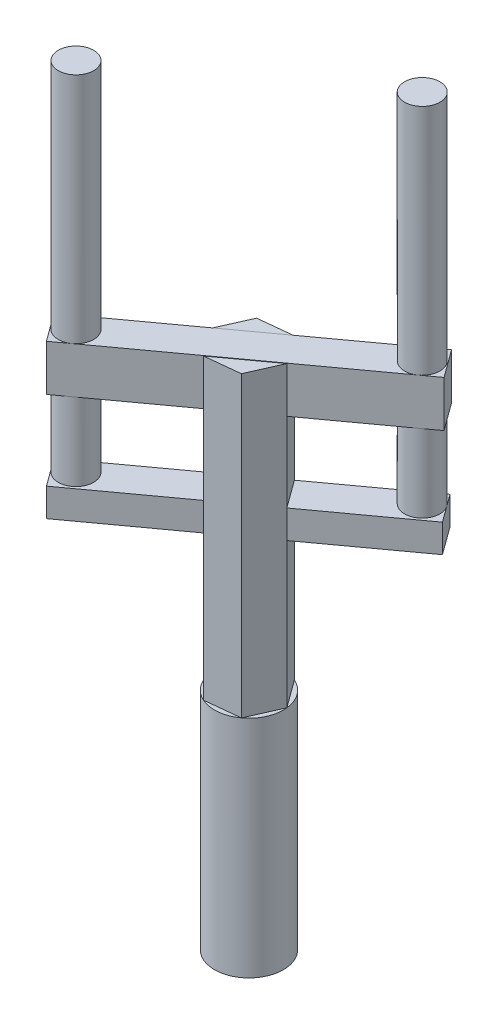
ISO-10303-21;
HEADER;
FILE_DESCRIPTION(('STEP AP214'),'2;1');
FILE_NAME('part.step','',(''),(''),'','','');
FILE_SCHEMA(('AUTOMOTIVE_DESIGN { 1 0 10303 214 1 1 1 1 }'));
ENDSEC;
DATA;
#1=APPLICATION_CONTEXT('core data for automotive mechanical design processes');
#2=APPLICATION_PROTOCOL_DEFINITION('international standard','automotive_design',2000,#1);
#3=PRODUCT_CONTEXT('',#1,'mechanical');
#4=PRODUCT('Part','Part','',(#3));
#5=PRODUCT_RELATED_PRODUCT_CATEGORY('part','',(#4));
#6=PRODUCT_DEFINITION_FORMATION('','',#4);
#7=PRODUCT_DEFINITION_CONTEXT('part definition',#1,'design');
#8=PRODUCT_DEFINITION('design','',#6,#7);
#9=PRODUCT_DEFINITION_SHAPE('','',#8);
#10=(LENGTH_UNIT() NAMED_UNIT(*) SI_UNIT(.MILLI.,.METRE.));
#11=(NAMED_UNIT(*) PLANE_ANGLE_UNIT() SI_UNIT($,.RADIAN.));
#12=(NAMED_UNIT(*) SI_UNIT($,.STERADIAN.) SOLID_ANGLE_UNIT());
#13=UNCERTAINTY_MEASURE_WITH_UNIT(LENGTH_MEASURE(1.E-05),#10,'distance_accuracy_value','');
#14=(GEOMETRIC_REPRESENTATION_CONTEXT(3) GLOBAL_UNCERTAINTY_ASSIGNED_CONTEXT((#13)) GLOBAL_UNIT_ASSIGNED_CONTEXT((#10,
#11,#12)) REPRESENTATION_CONTEXT('',''));
#15=CARTESIAN_POINT('',(0.,0.,0.));
#16=DIRECTION('',(0.,0.,1.));
#17=DIRECTION('',(1.,0.,0.));
#18=AXIS2_PLACEMENT_3D('',#15,#16,#17);
#19=CARTESIAN_POINT('',(30.448661583291,265.,-3.22145046028814));
#20=DIRECTION('',(-0.808612683037556,0.,0.588341337006677));
#21=DIRECTION('',(0.588341337006677,0.,0.808612683037556));
#22=AXIS2_PLACEMENT_3D('',#19,#20,#21);
#23=PLANE('',#22);
#24=DIRECTION('',(0.,-1.,0.));
#25=VECTOR('',#24,1.);
#26=CARTESIAN_POINT('',(30.448661583291,265.,-3.22145046028814));
#27=LINE('',#26,#25);
#28=CARTESIAN_POINT('',(30.448661583291,224.423299839827,-3.22145046028814));
#29=VERTEX_POINT('',#28);
#30=CARTESIAN_POINT('',(30.448661583291,153.840409793097,-3.22145046028814));
#31=VERTEX_POINT('',#30);
#32=EDGE_CURVE('E281',#29,#31,#27,.T.);
#33=ORIENTED_EDGE('',*,*,#32,.T.);
#34=DIRECTION('',(-0.588341337006677,0.,-0.808612683037556));
#35=VECTOR('',#34,1.);
#36=CARTESIAN_POINT('',(30.448661583291,153.840409793097,-3.22145046028814));
#37=LINE('',#36,#35);
#38=CARTESIAN_POINT('',(12.434472856003,153.840409793097,-27.9800396725094));
#39=VERTEX_POINT('',#38);
#40=EDGE_CURVE('E912',#31,#39,#37,.T.);
#41=ORIENTED_EDGE('',*,*,#40,.T.);
#42=DIRECTION('',(0.,-1.,0.));
#43=VECTOR('',#42,1.);
#44=CARTESIAN_POINT('',(12.4344728560029,265.,-27.9800396725094));
#45=LINE('',#44,#43);
#46=CARTESIAN_POINT('',(12.4344728560029,224.423299839827,-27.9800396725094));
#47=VERTEX_POINT('',#46);
#48=EDGE_CURVE('E245',#47,#39,#45,.T.);
#49=ORIENTED_EDGE('',*,*,#48,.F.);
#50=DIRECTION('',(0.588341337006677,0.,0.808612683037556));
#51=VECTOR('',#50,1.);
#52=CARTESIAN_POINT('',(30.448661583291,224.423299839827,-3.22145046028814));
#53=LINE('',#52,#51);
#54=EDGE_CURVE('E345',#47,#29,#53,.T.);
#55=ORIENTED_EDGE('',*,*,#54,.T.);
#56=EDGE_LOOP('',(#33,#41,#49,#55));
#57=FACE_BOUND('',#56,.T.);
#58=ADVANCED_FACE('F35',(#57),#23,.F.);
#59=CARTESIAN_POINT('',(-30.448661583291,265.,3.22145046028814));
#60=DIRECTION('',(0.808612683037557,0.,-0.588341337006677));
#61=DIRECTION('',(-0.588341337006677,0.,-0.808612683037557));
#62=AXIS2_PLACEMENT_3D('',#59,#60,#61);
#63=PLANE('',#62);
#64=DIRECTION('',(0.,-1.,0.));
#65=VECTOR('',#64,1.);
#66=CARTESIAN_POINT('',(-30.448661583291,265.,3.22145046028814));
#67=LINE('',#66,#65);
#68=CARTESIAN_POINT('',(-30.448661583291,224.423299839827,3.22145046028814));
#69=VERTEX_POINT('',#68);
#70=CARTESIAN_POINT('',(-30.448661583291,153.840409793097,3.22145046028813));
#71=VERTEX_POINT('',#70);
#72=EDGE_CURVE('E274',#69,#71,#67,.T.);
#73=ORIENTED_EDGE('',*,*,#72,.T.);
#74=DIRECTION('',(0.588341337006677,0.,0.808612683037557));
#75=VECTOR('',#74,1.);
#76=CARTESIAN_POINT('',(-30.448661583291,153.840409793097,3.22145046028814));
#77=LINE('',#76,#75);
#78=CARTESIAN_POINT('',(-12.4344728560029,153.840409793097,27.9800396725094));
#79=VERTEX_POINT('',#78);
#80=EDGE_CURVE('E11',#71,#79,#77,.T.);
#81=ORIENTED_EDGE('',*,*,#80,.T.);
#82=DIRECTION('',(0.,-1.,0.));
#83=VECTOR('',#82,1.);
#84=CARTESIAN_POINT('',(-12.4344728560029,265.,27.9800396725094));
#85=LINE('',#84,#83);
#86=CARTESIAN_POINT('',(-12.4344728560029,224.423299839827,27.9800396725094));
#87=VERTEX_POINT('',#86);
#88=EDGE_CURVE('E269',#87,#79,#85,.T.);
#89=ORIENTED_EDGE('',*,*,#88,.F.);
#90=DIRECTION('',(-0.588341337006677,0.,-0.808612683037557));
#91=VECTOR('',#90,1.);
#92=CARTESIAN_POINT('',(-30.448661583291,224.423299839827,3.22145046028814));
#93=LINE('',#92,#91);
#94=EDGE_CURVE('E290',#87,#69,#93,.T.);
#95=ORIENTED_EDGE('',*,*,#94,.T.);
#96=EDGE_LOOP('',(#73,#81,#89,#95));
#97=FACE_BOUND('',#96,.T.);
#98=ADVANCED_FACE('F320',(#97),#63,.F.);
#99=CARTESIAN_POINT('',(-111.283267648743,265.366360439089,62.0361848895122));
#100=DIRECTION('',(0.,1.,0.));
#101=DIRECTION('',(0.,0.,1.));
#102=AXIS2_PLACEMENT_3D('',#99,#100,#101);
#103=PLANE('',#102);
#104=CARTESIAN_POINT('',(88.8618182498193,265.366360439089,-65.1680361022988));
#105=DIRECTION('',(0.,1.,0.));
#106=DIRECTION('',(0.,0.,1.));
#107=AXIS2_PLACEMENT_3D('',#104,#105,#106);
#108=CIRCLE('',#107,15.7239201290361);
#109=CARTESIAN_POINT('',(98.1128504415227,265.366360439089,-52.4534748588905));
#110=VERTEX_POINT('',#109);
#111=CARTESIAN_POINT('',(84.1731503813959,265.366360439089,-80.176635565404));
#112=VERTEX_POINT('',#111);
#113=EDGE_CURVE('E408',#110,#112,#108,.T.);
#114=ORIENTED_EDGE('',*,*,#113,.F.);
#115=DIRECTION('',(0.808612683037556,0.,-0.588341337006677));
#116=VECTOR('',#115,1.);
#117=CARTESIAN_POINT('',(-93.2690789214552,265.366360439089,86.7947741017335));
#118=LINE('',#117,#116);
#119=CARTESIAN_POINT('',(111.309929887047,265.366360439089,-62.0555841609558));
#120=VERTEX_POINT('',#119);
#121=EDGE_CURVE('E355',#110,#120,#118,.T.);
#122=ORIENTED_EDGE('',*,*,#121,.T.);
#123=DIRECTION('',(0.588341337006677,0.,0.808612683037556));
#124=VECTOR('',#123,1.);
#125=CARTESIAN_POINT('',(93.2957411597584,265.366360439089,-86.814173373177));
#126=LINE('',#125,#124);
#127=CARTESIAN_POINT('',(93.2957411597584,265.366360439089,-86.814173373177));
#128=VERTEX_POINT('',#127);
#129=EDGE_CURVE('E437',#128,#120,#126,.T.);
#130=ORIENTED_EDGE('',*,*,#129,.F.);
#131=DIRECTION('',(0.808612683037556,0.,-0.588341337006677));
#132=VECTOR('',#131,1.);
#133=CARTESIAN_POINT('',(-111.283267648743,265.366360439089,62.0361848895122));
#134=LINE('',#133,#132);
#135=EDGE_CURVE('E384',#112,#128,#134,.T.);
#136=ORIENTED_EDGE('',*,*,#135,.F.);
#137=EDGE_LOOP('',(#114,#122,#130,#136));
#138=FACE_BOUND('',#137,.T.);
#139=ADVANCED_FACE('F462',(#138),#103,.T.);
#140=CARTESIAN_POINT('',(-111.283267648743,224.423299839827,62.0361848895122));
#141=DIRECTION('',(0.,-1.,0.));
#142=DIRECTION('',(0.,0.,-1.));
#143=AXIS2_PLACEMENT_3D('',#140,#141,#142);
#144=PLANE('',#143);
#145=CARTESIAN_POINT('',(88.8618182498193,224.423299839827,-65.1680361022988));
#146=DIRECTION('',(0.,-1.,0.));
#147=DIRECTION('',(0.,0.,-1.));
#148=AXIS2_PLACEMENT_3D('',#145,#146,#147);
#149=CIRCLE('',#148,15.7239201290361);
#150=CARTESIAN_POINT('',(98.1128504415227,224.423299839827,-52.4534748588905));
#151=VERTEX_POINT('',#150);
#152=CARTESIAN_POINT('',(76.0241730470732,224.423299839827,-74.2474925768197));
#153=VERTEX_POINT('',#152);
#154=EDGE_CURVE('E404',#151,#153,#149,.T.);
#155=ORIENTED_EDGE('',*,*,#154,.F.);
#156=DIRECTION('',(0.808612683037556,0.,-0.588341337006677));
#157=VECTOR('',#156,1.);
#158=CARTESIAN_POINT('',(-93.2690789214552,224.423299839827,86.7947741017335));
#159=LINE('',#158,#157);
#160=EDGE_CURVE('E392',#29,#151,#159,.T.);
#161=ORIENTED_EDGE('',*,*,#160,.F.);
#162=ORIENTED_EDGE('',*,*,#54,.F.);
#163=DIRECTION('',(0.808612683037556,0.,-0.588341337006677));
#164=VECTOR('',#163,1.);
#165=CARTESIAN_POINT('',(-111.283267648743,224.423299839827,62.0361848895122));
#166=LINE('',#165,#164);
#167=EDGE_CURVE('E381',#47,#153,#166,.T.);
#168=ORIENTED_EDGE('',*,*,#167,.T.);
#169=EDGE_LOOP('',(#155,#161,#162,#168));
#170=FACE_BOUND('',#169,.T.);
#171=ADVANCED_FACE('F471',(#170),#144,.T.);
#172=CARTESIAN_POINT('',(-111.283267648743,265.366360439089,62.0361848895122));
#173=DIRECTION('',(-0.588341337006677,0.,-0.808612683037556));
#174=DIRECTION('',(-0.808612683037556,0.,0.588341337006677));
#175=AXIS2_PLACEMENT_3D('',#172,#173,#174);
#176=PLANE('',#175);
#177=DIRECTION('',(0.,1.,0.));
#178=VECTOR('',#177,1.);
#179=CARTESIAN_POINT('',(76.0241730470732,155.366360439089,-74.2474925768196));
#180=LINE('',#179,#178);
#181=CARTESIAN_POINT('',(76.0241730470732,265.366360439089,-74.2474925768197));
#182=VERTEX_POINT('',#181);
#183=EDGE_CURVE('E300',#153,#182,#180,.T.);
#184=ORIENTED_EDGE('',*,*,#183,.F.);
#185=ORIENTED_EDGE('',*,*,#167,.F.);
#186=CARTESIAN_POINT('',(12.4344728560029,265.,-27.9800396725094));
#187=VERTEX_POINT('',#186);
#188=EDGE_CURVE('E248',#187,#47,#45,.T.);
#189=ORIENTED_EDGE('',*,*,#188,.F.);
#190=DIRECTION('',(-0.808612683037556,0.,0.588341337006677));
#191=VECTOR('',#190,1.);
#192=CARTESIAN_POINT('',(-9.00709436364406,265.,-12.3792946061106));
#193=LINE('',#192,#191);
#194=CARTESIAN_POINT('',(-30.448661583291,265.,3.22145046028814));
#195=VERTEX_POINT('',#194);
#196=EDGE_CURVE('E284',#187,#195,#193,.T.);
#197=ORIENTED_EDGE('',*,*,#196,.T.);
#198=EDGE_CURVE('E271',#195,#69,#67,.T.);
#199=ORIENTED_EDGE('',*,*,#198,.T.);
#200=CARTESIAN_POINT('',(-94.0116995360586,224.423299839827,49.4695040931552));
#201=VERTEX_POINT('',#200);
#202=EDGE_CURVE('E329',#201,#69,#166,.T.);
#203=ORIENTED_EDGE('',*,*,#202,.F.);
#204=DIRECTION('',(0.,1.,0.));
#205=VECTOR('',#204,1.);
#206=CARTESIAN_POINT('',(-94.0116995360586,155.366360439089,49.4695040931552));
#207=LINE('',#206,#205);
#208=CARTESIAN_POINT('',(-94.0116995360586,265.366360439089,49.4695040931552));
#209=VERTEX_POINT('',#208);
#210=EDGE_CURVE('E422',#209,#201,#207,.F.);
#211=ORIENTED_EDGE('',*,*,#210,.F.);
#212=EDGE_CURVE('E451',#209,#182,#134,.T.);
#213=ORIENTED_EDGE('',*,*,#212,.T.);
#214=EDGE_LOOP('',(#184,#185,#189,#197,#199,#203,#211,#213));
#215=FACE_BOUND('',#214,.T.);
#216=ADVANCED_FACE('F328',(#215),#176,.T.);
#217=CARTESIAN_POINT('',(-89.3230316676346,224.423299839827,64.4781035562602));
#218=DIRECTION('',(0.,-1.,0.));
#219=DIRECTION('',(0.,0.,-1.));
#220=AXIS2_PLACEMENT_3D('',#217,#218,#219);
#221=CIRCLE('',#220,15.7239201290361);
#222=CARTESIAN_POINT('',(-80.0719994759313,224.423299839827,77.1926647996683));
#223=VERTEX_POINT('',#222);
#224=CARTESIAN_POINT('',(-102.16067687038,224.423299839827,55.3986470817388));
#225=VERTEX_POINT('',#224);
#226=EDGE_CURVE('E428',#223,#225,#221,.T.);
#227=ORIENTED_EDGE('',*,*,#226,.F.);
#228=CARTESIAN_POINT('',(-93.2690789214552,224.423299839827,86.7947741017335));
#229=VERTEX_POINT('',#228);
#230=EDGE_CURVE('E357',#229,#223,#159,.T.);
#231=ORIENTED_EDGE('',*,*,#230,.F.);
#232=DIRECTION('',(-0.588341337006677,0.,-0.808612683037556));
#233=VECTOR('',#232,1.);
#234=CARTESIAN_POINT('',(-111.283267648743,224.423299839827,62.0361848895122));
#235=LINE('',#234,#233);
#236=CARTESIAN_POINT('',(-111.283267648743,224.423299839827,62.0361848895122));
#237=VERTEX_POINT('',#236);
#238=EDGE_CURVE('E442',#229,#237,#235,.T.);
#239=ORIENTED_EDGE('',*,*,#238,.T.);
#240=EDGE_CURVE('E380',#237,#225,#166,.T.);
#241=ORIENTED_EDGE('',*,*,#240,.T.);
#242=EDGE_LOOP('',(#227,#231,#239,#241));
#243=FACE_BOUND('',#242,.T.);
#244=ADVANCED_FACE('F479',(#243),#144,.T.);
#245=DIRECTION('',(0.,1.,0.));
#246=VECTOR('',#245,1.);
#247=CARTESIAN_POINT('',(-102.16067687038,155.366360439089,55.3986470817388));
#248=LINE('',#247,#246);
#249=CARTESIAN_POINT('',(-102.16067687038,265.366360439089,55.3986470817388));
#250=VERTEX_POINT('',#249);
#251=EDGE_CURVE('E424',#225,#250,#248,.T.);
#252=ORIENTED_EDGE('',*,*,#251,.F.);
#253=ORIENTED_EDGE('',*,*,#240,.F.);
#254=DIRECTION('',(0.,1.,0.));
#255=VECTOR('',#254,1.);
#256=CARTESIAN_POINT('',(-111.283267648743,265.366360439089,62.0361848895122));
#257=LINE('',#256,#255);
#258=CARTESIAN_POINT('',(-111.283267648743,265.366360439089,62.0361848895122));
#259=VERTEX_POINT('',#258);
#260=EDGE_CURVE('E445',#237,#259,#257,.T.);
#261=ORIENTED_EDGE('',*,*,#260,.T.);
#262=EDGE_CURVE('E449',#259,#250,#134,.T.);
#263=ORIENTED_EDGE('',*,*,#262,.T.);
#264=EDGE_LOOP('',(#252,#253,#261,#263));
#265=FACE_BOUND('',#264,.T.);
#266=ADVANCED_FACE('F505',(#265),#176,.T.);
#267=EDGE_CURVE('E415',#182,#110,#108,.T.);
#268=ORIENTED_EDGE('',*,*,#267,.F.);
#269=ORIENTED_EDGE('',*,*,#212,.F.);
#270=CARTESIAN_POINT('',(-89.3230316676346,265.366360439089,64.4781035562602));
#271=DIRECTION('',(0.,1.,0.));
#272=DIRECTION('',(0.,0.,1.));
#273=AXIS2_PLACEMENT_3D('',#270,#271,#272);
#274=CIRCLE('',#273,15.7239201290361);
#275=CARTESIAN_POINT('',(-80.0719994759313,265.366360439089,77.1926647996683));
#276=VERTEX_POINT('',#275);
#277=EDGE_CURVE('E296',#276,#209,#274,.T.);
#278=ORIENTED_EDGE('',*,*,#277,.F.);
#279=EDGE_CURVE('E353',#276,#110,#118,.T.);
#280=ORIENTED_EDGE('',*,*,#279,.T.);
#281=EDGE_LOOP('',(#268,#269,#278,#280));
#282=FACE_BOUND('',#281,.T.);
#283=ADVANCED_FACE('F468',(#282),#103,.T.);
#284=CARTESIAN_POINT('',(0.,265.,0.));
#285=DIRECTION('',(0.,1.,0.));
#286=DIRECTION('',(0.,0.,1.));
#287=AXIS2_PLACEMENT_3D('',#284,#285,#286);
#288=PLANE('',#287);
#289=DIRECTION('',(0.808612683037556,0.,-0.588341337006677));
#290=VECTOR('',#289,1.);
#291=CARTESIAN_POINT('',(9.00709436364406,265.,12.3792946061106));
#292=LINE('',#291,#290);
#293=CARTESIAN_POINT('',(-12.4344728560029,265.,27.9800396725094));
#294=VERTEX_POINT('',#293);
#295=CARTESIAN_POINT('',(30.448661583291,265.,-3.22145046028814));
#296=VERTEX_POINT('',#295);
#297=EDGE_CURVE('E287',#294,#296,#292,.T.);
#298=ORIENTED_EDGE('',*,*,#297,.F.);
#299=DIRECTION('',(0.994449793836157,0.,-0.105212202425506));
#300=VECTOR('',#299,1.);
#301=CARTESIAN_POINT('',(-12.4344728560029,265.,27.9800396725094));
#302=LINE('',#301,#300);
#303=CARTESIAN_POINT('',(18.0141887272881,265.,24.7585892122213));
#304=VERTEX_POINT('',#303);
#305=EDGE_CURVE('E264',#294,#304,#302,.T.);
#306=ORIENTED_EDGE('',*,*,#305,.T.);
#307=DIRECTION('',(0.406108456829479,0.,-0.913824885463062));
#308=VECTOR('',#307,1.);
#309=CARTESIAN_POINT('',(18.0141887272881,265.,24.7585892122213));
#310=LINE('',#309,#308);
#311=EDGE_CURVE('E339',#304,#296,#310,.T.);
#312=ORIENTED_EDGE('',*,*,#311,.T.);
#313=EDGE_LOOP('',(#298,#306,#312));
#314=FACE_BOUND('',#313,.T.);
#315=ADVANCED_FACE('F362',(#314),#288,.T.);
#316=CARTESIAN_POINT('',(-12.4344728560029,265.,27.9800396725094));
#317=DIRECTION('',(-0.105212202425506,0.,-0.994449793836157));
#318=DIRECTION('',(-0.994449793836157,0.,0.105212202425506));
#319=AXIS2_PLACEMENT_3D('',#316,#317,#318);
#320=PLANE('',#319);
#321=DIRECTION('',(0.994449793836157,0.,-0.105212202425506));
#322=VECTOR('',#321,1.);
#323=CARTESIAN_POINT('',(-12.4344728560029,0.,27.9800396725094));
#324=LINE('',#323,#322);
#325=CARTESIAN_POINT('',(-12.4344728560029,0.,27.9800396725094));
#326=VERTEX_POINT('',#325);
#327=CARTESIAN_POINT('',(18.0141887272881,0.,24.7585892122212));
#328=VERTEX_POINT('',#327);
#329=EDGE_CURVE('E255',#326,#328,#324,.T.);
#330=ORIENTED_EDGE('',*,*,#329,.T.);
#331=DIRECTION('',(0.,-1.,0.));
#332=VECTOR('',#331,1.);
#333=CARTESIAN_POINT('',(18.0141887272881,265.,24.7585892122213));
#334=LINE('',#333,#332);
#335=EDGE_CURVE('E280',#304,#328,#334,.T.);
#336=ORIENTED_EDGE('',*,*,#335,.F.);
#337=ORIENTED_EDGE('',*,*,#305,.F.);
#338=EDGE_CURVE('E265',#294,#87,#85,.T.);
#339=ORIENTED_EDGE('',*,*,#338,.T.);
#340=ORIENTED_EDGE('',*,*,#88,.T.);
#341=CARTESIAN_POINT('',(-12.4344728560029,128.764930890471,27.9800396725094));
#342=VERTEX_POINT('',#341);
#343=EDGE_CURVE('E925',#79,#342,#85,.T.);
#344=ORIENTED_EDGE('',*,*,#343,.T.);
#345=EDGE_CURVE('E270',#342,#326,#85,.T.);
#346=ORIENTED_EDGE('',*,*,#345,.T.);
#347=EDGE_LOOP('',(#330,#336,#337,#339,#340,#344,#346));
#348=FACE_BOUND('',#347,.T.);
#349=ADVANCED_FACE('F37',(#348),#320,.F.);
#350=CARTESIAN_POINT('',(18.0141887272881,265.,24.7585892122213));
#351=DIRECTION('',(-0.913824885463062,0.,-0.406108456829479));
#352=DIRECTION('',(-0.406108456829479,0.,0.913824885463062));
#353=AXIS2_PLACEMENT_3D('',#350,#351,#352);
#354=PLANE('',#353);
#355=DIRECTION('',(0.406108456829479,0.,-0.913824885463062));
#356=VECTOR('',#355,1.);
#357=CARTESIAN_POINT('',(18.0141887272881,0.,24.7585892122213));
#358=LINE('',#357,#356);
#359=CARTESIAN_POINT('',(30.448661583291,0.,-3.22145046028814));
#360=VERTEX_POINT('',#359);
#361=EDGE_CURVE('E253',#328,#360,#358,.T.);
#362=ORIENTED_EDGE('',*,*,#361,.T.);
#363=CARTESIAN_POINT('',(30.448661583291,128.764930890471,-3.22145046028814));
#364=VERTEX_POINT('',#363);
#365=EDGE_CURVE('E251',#364,#360,#27,.T.);
#366=ORIENTED_EDGE('',*,*,#365,.F.);
#367=DIRECTION('',(0.,1.,0.));
#368=VECTOR('',#367,1.);
#369=CARTESIAN_POINT('',(30.448661583291,265.,-3.22145046028814));
#370=LINE('',#369,#368);
#371=EDGE_CURVE('E915',#364,#31,#370,.T.);
#372=ORIENTED_EDGE('',*,*,#371,.T.);
#373=ORIENTED_EDGE('',*,*,#32,.F.);
#374=EDGE_CURVE('E277',#296,#29,#27,.T.);
#375=ORIENTED_EDGE('',*,*,#374,.F.);
#376=ORIENTED_EDGE('',*,*,#311,.F.);
#377=ORIENTED_EDGE('',*,*,#335,.T.);
#378=EDGE_LOOP('',(#362,#366,#372,#373,#375,#376,#377));
#379=FACE_BOUND('',#378,.T.);
#380=ADVANCED_FACE('F366',(#379),#354,.F.);
#381=CARTESIAN_POINT('',(12.4344728560029,128.764930890471,-27.9800396725094));
#382=VERTEX_POINT('',#381);
#383=CARTESIAN_POINT('',(12.4344728560029,0.,-27.9800396725094));
#384=VERTEX_POINT('',#383);
#385=EDGE_CURVE('E239',#382,#384,#45,.T.);
#386=ORIENTED_EDGE('',*,*,#385,.F.);
#387=DIRECTION('',(0.588341337006677,0.,0.808612683037556));
#388=VECTOR('',#387,1.);
#389=CARTESIAN_POINT('',(30.448661583291,128.764930890471,-3.22145046028814));
#390=LINE('',#389,#388);
#391=EDGE_CURVE('E902',#382,#364,#390,.T.);
#392=ORIENTED_EDGE('',*,*,#391,.T.);
#393=ORIENTED_EDGE('',*,*,#365,.T.);
#394=DIRECTION('',(-0.588341337006677,0.,-0.808612683037557));
#395=VECTOR('',#394,1.);
#396=CARTESIAN_POINT('',(30.448661583291,0.,-3.22145046028814));
#397=LINE('',#396,#395);
#398=EDGE_CURVE('E218',#360,#384,#397,.T.);
#399=ORIENTED_EDGE('',*,*,#398,.T.);
#400=EDGE_LOOP('',(#386,#392,#393,#399));
#401=FACE_BOUND('',#400,.T.);
#402=ADVANCED_FACE('F249',(#401),#23,.F.);
#403=CARTESIAN_POINT('',(12.4344728560029,265.,-27.9800396725094));
#404=DIRECTION('',(0.105212202425506,0.,0.994449793836157));
#405=DIRECTION('',(0.994449793836157,0.,-0.105212202425506));
#406=AXIS2_PLACEMENT_3D('',#403,#404,#405);
#407=PLANE('',#406);
#408=DIRECTION('',(-0.994449793836157,0.,0.105212202425506));
#409=VECTOR('',#408,1.);
#410=CARTESIAN_POINT('',(12.4344728560029,0.,-27.9800396725094));
#411=LINE('',#410,#409);
#412=CARTESIAN_POINT('',(-18.0141887272881,0.,-24.7585892122213));
#413=VERTEX_POINT('',#412);
#414=EDGE_CURVE('E208',#384,#413,#411,.T.);
#415=ORIENTED_EDGE('',*,*,#414,.T.);
#416=DIRECTION('',(0.,-1.,0.));
#417=VECTOR('',#416,1.);
#418=CARTESIAN_POINT('',(-18.0141887272881,265.,-24.7585892122213));
#419=LINE('',#418,#417);
#420=CARTESIAN_POINT('',(-18.0141887272881,265.,-24.7585892122213));
#421=VERTEX_POINT('',#420);
#422=EDGE_CURVE('E246',#421,#413,#419,.T.);
#423=ORIENTED_EDGE('',*,*,#422,.F.);
#424=DIRECTION('',(-0.994449793836157,0.,0.105212202425506));
#425=VECTOR('',#424,1.);
#426=CARTESIAN_POINT('',(12.4344728560029,265.,-27.9800396725094));
#427=LINE('',#426,#425);
#428=EDGE_CURVE('E336',#187,#421,#427,.T.);
#429=ORIENTED_EDGE('',*,*,#428,.F.);
#430=ORIENTED_EDGE('',*,*,#188,.T.);
#431=ORIENTED_EDGE('',*,*,#48,.T.);
#432=DIRECTION('',(0.,-1.,0.));
#433=VECTOR('',#432,1.);
#434=CARTESIAN_POINT('',(12.4344728560029,265.,-27.9800396725094));
#435=LINE('',#434,#433);
#436=EDGE_CURVE('E242',#39,#382,#435,.T.);
#437=ORIENTED_EDGE('',*,*,#436,.T.);
#438=ORIENTED_EDGE('',*,*,#385,.T.);
#439=EDGE_LOOP('',(#415,#423,#429,#430,#431,#437,#438));
#440=FACE_BOUND('',#439,.T.);
#441=ADVANCED_FACE('F240',(#440),#407,.F.);
#442=CARTESIAN_POINT('',(-18.0141887272881,265.,-24.7585892122213));
#443=DIRECTION('',(0.913824885463062,0.,0.406108456829479));
#444=DIRECTION('',(0.406108456829479,0.,-0.913824885463062));
#445=AXIS2_PLACEMENT_3D('',#442,#443,#444);
#446=PLANE('',#445);
#447=DIRECTION('',(-0.406108456829479,0.,0.913824885463062));
#448=VECTOR('',#447,1.);
#449=CARTESIAN_POINT('',(-18.0141887272881,0.,-24.7585892122213));
#450=LINE('',#449,#448);
#451=CARTESIAN_POINT('',(-30.448661583291,0.,3.22145046028816));
#452=VERTEX_POINT('',#451);
#453=EDGE_CURVE('E217',#413,#452,#450,.T.);
#454=ORIENTED_EDGE('',*,*,#453,.T.);
#455=CARTESIAN_POINT('',(-30.448661583291,128.764930890471,3.22145046028814));
#456=VERTEX_POINT('',#455);
#457=EDGE_CURVE('E268',#456,#452,#67,.T.);
#458=ORIENTED_EDGE('',*,*,#457,.F.);
#459=EDGE_CURVE('E315',#71,#456,#67,.T.);
#460=ORIENTED_EDGE('',*,*,#459,.F.);
#461=ORIENTED_EDGE('',*,*,#72,.F.);
#462=ORIENTED_EDGE('',*,*,#198,.F.);
#463=DIRECTION('',(-0.406108456829479,0.,0.913824885463062));
#464=VECTOR('',#463,1.);
#465=CARTESIAN_POINT('',(-18.0141887272881,265.,-24.7585892122213));
#466=LINE('',#465,#464);
#467=EDGE_CURVE('E337',#421,#195,#466,.T.);
#468=ORIENTED_EDGE('',*,*,#467,.F.);
#469=ORIENTED_EDGE('',*,*,#422,.T.);
#470=EDGE_LOOP('',(#454,#458,#460,#461,#462,#468,#469));
#471=FACE_BOUND('',#470,.T.);
#472=ADVANCED_FACE('F313',(#471),#446,.F.);
#473=ORIENTED_EDGE('',*,*,#345,.F.);
#474=DIRECTION('',(-0.588341337006677,0.,-0.808612683037557));
#475=VECTOR('',#474,1.);
#476=CARTESIAN_POINT('',(-30.448661583291,128.764930890471,3.22145046028814));
#477=LINE('',#476,#475);
#478=EDGE_CURVE('E43',#342,#456,#477,.T.);
#479=ORIENTED_EDGE('',*,*,#478,.T.);
#480=ORIENTED_EDGE('',*,*,#457,.T.);
#481=DIRECTION('',(0.588341337006677,0.,0.808612683037557));
#482=VECTOR('',#481,1.);
#483=CARTESIAN_POINT('',(-30.448661583291,0.,3.22145046028814));
#484=LINE('',#483,#482);
#485=EDGE_CURVE('E261',#452,#326,#484,.T.);
#486=ORIENTED_EDGE('',*,*,#485,.T.);
#487=EDGE_LOOP('',(#473,#479,#480,#486));
#488=FACE_BOUND('',#487,.T.);
#489=ADVANCED_FACE('F307',(#488),#63,.F.);
#490=ORIENTED_EDGE('',*,*,#196,.F.);
#491=ORIENTED_EDGE('',*,*,#428,.T.);
#492=ORIENTED_EDGE('',*,*,#467,.T.);
#493=EDGE_LOOP('',(#490,#491,#492));
#494=FACE_BOUND('',#493,.T.);
#495=ADVANCED_FACE('F335',(#494),#288,.T.);
#496=CARTESIAN_POINT('',(84.1731503813959,224.423299839827,-80.176635565404));
#497=VERTEX_POINT('',#496);
#498=EDGE_CURVE('E401',#497,#151,#149,.T.);
#499=ORIENTED_EDGE('',*,*,#498,.F.);
#500=CARTESIAN_POINT('',(93.2957411597584,224.423299839827,-86.814173373177));
#501=VERTEX_POINT('',#500);
#502=EDGE_CURVE('E382',#497,#501,#166,.T.);
#503=ORIENTED_EDGE('',*,*,#502,.T.);
#504=DIRECTION('',(-0.588341337006677,0.,-0.808612683037556));
#505=VECTOR('',#504,1.);
#506=CARTESIAN_POINT('',(93.2957411597584,224.423299839827,-86.814173373177));
#507=LINE('',#506,#505);
#508=CARTESIAN_POINT('',(111.309929887047,224.423299839827,-62.0555841609558));
#509=VERTEX_POINT('',#508);
#510=EDGE_CURVE('E432',#509,#501,#507,.T.);
#511=ORIENTED_EDGE('',*,*,#510,.F.);
#512=EDGE_CURVE('E391',#151,#509,#159,.T.);
#513=ORIENTED_EDGE('',*,*,#512,.F.);
#514=EDGE_LOOP('',(#499,#503,#511,#513));
#515=FACE_BOUND('',#514,.T.);
#516=ADVANCED_FACE('F472',(#515),#144,.T.);
#517=EDGE_CURVE('E379',#201,#223,#221,.T.);
#518=ORIENTED_EDGE('',*,*,#517,.F.);
#519=ORIENTED_EDGE('',*,*,#202,.T.);
#520=ORIENTED_EDGE('',*,*,#94,.F.);
#521=EDGE_CURVE('E375',#223,#87,#159,.T.);
#522=ORIENTED_EDGE('',*,*,#521,.F.);
#523=EDGE_LOOP('',(#518,#519,#520,#522));
#524=FACE_BOUND('',#523,.T.);
#525=ADVANCED_FACE('F377',(#524),#144,.T.);
#526=CARTESIAN_POINT('',(-93.2690789214552,265.366360439089,86.7947741017335));
#527=DIRECTION('',(0.588341337006677,0.,0.808612683037556));
#528=DIRECTION('',(0.808612683037556,0.,-0.588341337006677));
#529=AXIS2_PLACEMENT_3D('',#526,#527,#528);
#530=PLANE('',#529);
#531=ORIENTED_EDGE('',*,*,#121,.F.);
#532=ORIENTED_EDGE('',*,*,#279,.F.);
#533=CARTESIAN_POINT('',(-93.2690789214552,265.366360439089,86.7947741017335));
#534=VERTEX_POINT('',#533);
#535=EDGE_CURVE('E348',#534,#276,#118,.T.);
#536=ORIENTED_EDGE('',*,*,#535,.F.);
#537=DIRECTION('',(0.,-1.,0.));
#538=VECTOR('',#537,1.);
#539=CARTESIAN_POINT('',(-93.2690789214552,265.366360439089,86.7947741017335));
#540=LINE('',#539,#538);
#541=EDGE_CURVE('E440',#534,#229,#540,.T.);
#542=ORIENTED_EDGE('',*,*,#541,.T.);
#543=ORIENTED_EDGE('',*,*,#230,.T.);
#544=ORIENTED_EDGE('',*,*,#521,.T.);
#545=ORIENTED_EDGE('',*,*,#338,.F.);
#546=ORIENTED_EDGE('',*,*,#297,.T.);
#547=ORIENTED_EDGE('',*,*,#374,.T.);
#548=ORIENTED_EDGE('',*,*,#160,.T.);
#549=ORIENTED_EDGE('',*,*,#512,.T.);
#550=DIRECTION('',(0.,-1.,0.));
#551=VECTOR('',#550,1.);
#552=CARTESIAN_POINT('',(111.309929887047,265.366360439089,-62.0555841609558));
#553=LINE('',#552,#551);
#554=EDGE_CURVE('E429',#120,#509,#553,.T.);
#555=ORIENTED_EDGE('',*,*,#554,.F.);
#556=EDGE_LOOP('',(#531,#532,#536,#542,#543,#544,#545,#546,#547,#548,#549,#555));
#557=FACE_BOUND('',#556,.T.);
#558=ADVANCED_FACE('F372',(#557),#530,.T.);
#559=DIRECTION('',(0.,1.,0.));
#560=VECTOR('',#559,1.);
#561=CARTESIAN_POINT('',(84.1731503813959,155.366360439089,-80.176635565404));
#562=LINE('',#561,#560);
#563=EDGE_CURVE('E297',#112,#497,#562,.F.);
#564=ORIENTED_EDGE('',*,*,#563,.F.);
#565=ORIENTED_EDGE('',*,*,#135,.T.);
#566=DIRECTION('',(0.,1.,0.));
#567=VECTOR('',#566,1.);
#568=CARTESIAN_POINT('',(93.2957411597584,265.366360439089,-86.814173373177));
#569=LINE('',#568,#567);
#570=EDGE_CURVE('E434',#501,#128,#569,.T.);
#571=ORIENTED_EDGE('',*,*,#570,.F.);
#572=ORIENTED_EDGE('',*,*,#502,.F.);
#573=EDGE_LOOP('',(#564,#565,#571,#572));
#574=FACE_BOUND('',#573,.T.);
#575=ADVANCED_FACE('F457',(#574),#176,.T.);
#576=EDGE_CURVE('E293',#250,#276,#274,.T.);
#577=ORIENTED_EDGE('',*,*,#576,.F.);
#578=ORIENTED_EDGE('',*,*,#262,.F.);
#579=DIRECTION('',(0.588341337006677,0.,0.808612683037556));
#580=VECTOR('',#579,1.);
#581=CARTESIAN_POINT('',(-111.283267648743,265.366360439089,62.0361848895122));
#582=LINE('',#581,#580);
#583=EDGE_CURVE('E394',#259,#534,#582,.T.);
#584=ORIENTED_EDGE('',*,*,#583,.T.);
#585=ORIENTED_EDGE('',*,*,#535,.T.);
#586=EDGE_LOOP('',(#577,#578,#584,#585));
#587=FACE_BOUND('',#586,.T.);
#588=ADVANCED_FACE('F507',(#587),#103,.T.);
#589=CARTESIAN_POINT('',(-102.276173285099,0.,74.4154794956229));
#590=DIRECTION('',(-0.808612683037556,0.,0.588341337006677));
#591=DIRECTION('',(0.588341337006677,0.,0.808612683037556));
#592=AXIS2_PLACEMENT_3D('',#589,#590,#591);
#593=PLANE('',#592);
#594=ORIENTED_EDGE('',*,*,#541,.F.);
#595=ORIENTED_EDGE('',*,*,#583,.F.);
#596=ORIENTED_EDGE('',*,*,#260,.F.);
#597=ORIENTED_EDGE('',*,*,#238,.F.);
#598=EDGE_LOOP('',(#594,#595,#596,#597));
#599=FACE_BOUND('',#598,.T.);
#600=ADVANCED_FACE('F531',(#599),#593,.T.);
#601=CARTESIAN_POINT('',(102.302835523402,0.,-74.4348787670664));
#602=DIRECTION('',(-0.808612683037556,0.,0.588341337006677));
#603=DIRECTION('',(0.588341337006677,0.,0.808612683037556));
#604=AXIS2_PLACEMENT_3D('',#601,#602,#603);
#605=PLANE('',#604);
#606=ORIENTED_EDGE('',*,*,#554,.T.);
#607=ORIENTED_EDGE('',*,*,#510,.T.);
#608=ORIENTED_EDGE('',*,*,#570,.T.);
#609=ORIENTED_EDGE('',*,*,#129,.T.);
#610=EDGE_LOOP('',(#606,#607,#608,#609));
#611=FACE_BOUND('',#610,.T.);
#612=ADVANCED_FACE('F461',(#611),#605,.F.);
#613=CARTESIAN_POINT('',(-89.3230316676346,155.366360439089,64.4781035562602));
#614=DIRECTION('',(0.,1.,0.));
#615=DIRECTION('',(0.,0.,1.));
#616=AXIS2_PLACEMENT_3D('',#613,#614,#615);
#617=CYLINDRICAL_SURFACE('',#616,15.7239201290361);
#618=ORIENTED_EDGE('',*,*,#517,.T.);
#619=ORIENTED_EDGE('',*,*,#226,.T.);
#620=ORIENTED_EDGE('',*,*,#251,.T.);
#621=ORIENTED_EDGE('',*,*,#576,.T.);
#622=ORIENTED_EDGE('',*,*,#277,.T.);
#623=ORIENTED_EDGE('',*,*,#210,.T.);
#624=EDGE_LOOP('',(#618,#619,#620,#621,#622,#623));
#625=FACE_BOUND('',#624,.T.);
#626=CARTESIAN_POINT('',(-89.3230316676346,155.366360439089,64.4781035562602));
#627=DIRECTION('',(0.,1.,0.));
#628=DIRECTION('',(0.,0.,1.));
#629=AXIS2_PLACEMENT_3D('',#626,#627,#628);
#630=CIRCLE('',#629,15.7239201290361);
#631=CARTESIAN_POINT('',(-89.3230316676346,155.366360439089,80.2020236852963));
#632=VERTEX_POINT('',#631);
#633=EDGE_CURVE('E419',#632,#632,#630,.T.);
#634=ORIENTED_EDGE('',*,*,#633,.T.);
#635=EDGE_LOOP('',(#634));
#636=FACE_BOUND('',#635,.T.);
#637=CARTESIAN_POINT('',(-89.3230316676346,472.366360439089,64.4781035562602));
#638=DIRECTION('',(0.,1.,0.));
#639=DIRECTION('',(0.,0.,1.));
#640=AXIS2_PLACEMENT_3D('',#637,#638,#639);
#641=CIRCLE('',#640,15.7239201290361);
#642=CARTESIAN_POINT('',(-89.3230316676346,472.366360439089,80.2020236852963));
#643=VERTEX_POINT('',#642);
#644=EDGE_CURVE('E416',#643,#643,#641,.T.);
#645=ORIENTED_EDGE('',*,*,#644,.F.);
#646=EDGE_LOOP('',(#645));
#647=FACE_BOUND('',#646,.T.);
#648=ADVANCED_FACE('F547',(#625,#636,#647),#617,.T.);
#649=CARTESIAN_POINT('',(-89.3230316676346,155.366360439089,64.4781035562602));
#650=DIRECTION('',(0.,1.,0.));
#651=DIRECTION('',(0.,0.,1.));
#652=AXIS2_PLACEMENT_3D('',#649,#650,#651);
#653=PLANE('',#652);
#654=ORIENTED_EDGE('',*,*,#633,.F.);
#655=EDGE_LOOP('',(#654));
#656=FACE_BOUND('',#655,.T.);
#657=ADVANCED_FACE('F627',(#656),#653,.F.);
#658=CARTESIAN_POINT('',(-89.3230316676346,472.366360439089,64.4781035562602));
#659=DIRECTION('',(0.,1.,0.));
#660=DIRECTION('',(0.,0.,1.));
#661=AXIS2_PLACEMENT_3D('',#658,#659,#660);
#662=PLANE('',#661);
#663=ORIENTED_EDGE('',*,*,#644,.T.);
#664=EDGE_LOOP('',(#663));
#665=FACE_BOUND('',#664,.T.);
#666=ADVANCED_FACE('F637',(#665),#662,.T.);
#667=CARTESIAN_POINT('',(88.8618182498193,155.366360439089,-65.1680361022988));
#668=DIRECTION('',(0.,1.,0.));
#669=DIRECTION('',(0.,0.,1.));
#670=AXIS2_PLACEMENT_3D('',#667,#668,#669);
#671=CYLINDRICAL_SURFACE('',#670,15.7239201290361);
#672=ORIENTED_EDGE('',*,*,#183,.T.);
#673=ORIENTED_EDGE('',*,*,#267,.T.);
#674=ORIENTED_EDGE('',*,*,#113,.T.);
#675=ORIENTED_EDGE('',*,*,#563,.T.);
#676=ORIENTED_EDGE('',*,*,#498,.T.);
#677=ORIENTED_EDGE('',*,*,#154,.T.);
#678=EDGE_LOOP('',(#672,#673,#674,#675,#676,#677));
#679=FACE_BOUND('',#678,.T.);
#680=CARTESIAN_POINT('',(88.8618182498193,155.366360439089,-65.1680361022988));
#681=DIRECTION('',(0.,1.,0.));
#682=DIRECTION('',(0.,0.,-1.));
#683=AXIS2_PLACEMENT_3D('',#680,#681,#682);
#684=CIRCLE('',#683,15.7239201290361);
#685=CARTESIAN_POINT('',(88.8618182498193,155.366360439089,-80.8919562313349));
#686=VERTEX_POINT('',#685);
#687=EDGE_CURVE('E406',#686,#686,#684,.T.);
#688=ORIENTED_EDGE('',*,*,#687,.T.);
#689=EDGE_LOOP('',(#688));
#690=FACE_BOUND('',#689,.T.);
#691=CARTESIAN_POINT('',(88.8618182498193,472.366360439089,-65.1680361022988));
#692=DIRECTION('',(0.,1.,0.));
#693=DIRECTION('',(0.,0.,-1.));
#694=AXIS2_PLACEMENT_3D('',#691,#692,#693);
#695=CIRCLE('',#694,15.7239201290361);
#696=CARTESIAN_POINT('',(88.8618182498193,472.366360439089,-80.8919562313349));
#697=VERTEX_POINT('',#696);
#698=EDGE_CURVE('E410',#697,#697,#695,.T.);
#699=ORIENTED_EDGE('',*,*,#698,.F.);
#700=EDGE_LOOP('',(#699));
#701=FACE_BOUND('',#700,.T.);
#702=ADVANCED_FACE('F402',(#679,#690,#701),#671,.T.);
#703=CARTESIAN_POINT('',(88.8618182498193,155.366360439089,-65.1680361022988));
#704=DIRECTION('',(0.,-1.,0.));
#705=DIRECTION('',(0.,0.,-1.));
#706=AXIS2_PLACEMENT_3D('',#703,#704,#705);
#707=PLANE('',#706);
#708=ORIENTED_EDGE('',*,*,#687,.F.);
#709=EDGE_LOOP('',(#708));
#710=FACE_BOUND('',#709,.T.);
#711=ADVANCED_FACE('F656',(#710),#707,.T.);
#712=CARTESIAN_POINT('',(88.8618182498193,472.366360439089,-65.1680361022988));
#713=DIRECTION('',(0.,-1.,0.));
#714=DIRECTION('',(0.,0.,-1.));
#715=AXIS2_PLACEMENT_3D('',#712,#713,#714);
#716=PLANE('',#715);
#717=ORIENTED_EDGE('',*,*,#698,.T.);
#718=EDGE_LOOP('',(#717));
#719=FACE_BOUND('',#718,.T.);
#720=ADVANCED_FACE('F665',(#719),#716,.F.);
#721=CARTESIAN_POINT('',(-102.276173285099,0.,74.4154794956229));
#722=DIRECTION('',(0.808612683037556,0.,-0.588341337006677));
#723=DIRECTION('',(-0.588341337006677,0.,-0.808612683037556));
#724=AXIS2_PLACEMENT_3D('',#721,#722,#723);
#725=PLANE('',#724);
#726=DIRECTION('',(0.,-1.,0.));
#727=VECTOR('',#726,1.);
#728=CARTESIAN_POINT('',(-93.2690789214551,153.840409793097,86.7947741017335));
#729=LINE('',#728,#727);
#730=CARTESIAN_POINT('',(-93.2690789214551,153.840409793097,86.7947741017335));
#731=VERTEX_POINT('',#730);
#732=CARTESIAN_POINT('',(-93.2690789214551,128.764930890471,86.7947741017335));
#733=VERTEX_POINT('',#732);
#734=EDGE_CURVE('E887',#731,#733,#729,.T.);
#735=ORIENTED_EDGE('',*,*,#734,.F.);
#736=DIRECTION('',(0.588341337006677,0.,0.808612683037556));
#737=VECTOR('',#736,1.);
#738=CARTESIAN_POINT('',(-93.2690789214551,153.840409793097,86.7947741017335));
#739=LINE('',#738,#737);
#740=CARTESIAN_POINT('',(-111.283267648743,153.840409793097,62.0361848895122));
#741=VERTEX_POINT('',#740);
#742=EDGE_CURVE('E895',#741,#731,#739,.T.);
#743=ORIENTED_EDGE('',*,*,#742,.F.);
#744=DIRECTION('',(0.,1.,0.));
#745=VECTOR('',#744,1.);
#746=CARTESIAN_POINT('',(-111.283267648743,153.840409793097,62.0361848895122));
#747=LINE('',#746,#745);
#748=CARTESIAN_POINT('',(-111.283267648743,128.764930890471,62.0361848895122));
#749=VERTEX_POINT('',#748);
#750=EDGE_CURVE('E892',#749,#741,#747,.T.);
#751=ORIENTED_EDGE('',*,*,#750,.F.);
#752=DIRECTION('',(-0.588341337006677,0.,-0.808612683037556));
#753=VECTOR('',#752,1.);
#754=CARTESIAN_POINT('',(-93.2690789214551,128.764930890471,86.7947741017335));
#755=LINE('',#754,#753);
#756=EDGE_CURVE('E890',#733,#749,#755,.T.);
#757=ORIENTED_EDGE('',*,*,#756,.F.);
#758=EDGE_LOOP('',(#735,#743,#751,#757));
#759=FACE_BOUND('',#758,.T.);
#760=ADVANCED_FACE('F674',(#759),#725,.F.);
#761=CARTESIAN_POINT('',(-93.2690789214551,128.764930890471,86.7947741017335));
#762=DIRECTION('',(0.,-1.,0.));
#763=DIRECTION('',(0.,0.,-1.));
#764=AXIS2_PLACEMENT_3D('',#761,#762,#763);
#765=PLANE('',#764);
#766=ORIENTED_EDGE('',*,*,#478,.F.);
#767=DIRECTION('',(0.808612683037557,0.,-0.588341337006677));
#768=VECTOR('',#767,1.);
#769=CARTESIAN_POINT('',(-93.2690789214551,128.764930890471,86.7947741017335));
#770=LINE('',#769,#768);
#771=EDGE_CURVE('E908',#733,#342,#770,.T.);
#772=ORIENTED_EDGE('',*,*,#771,.F.);
#773=ORIENTED_EDGE('',*,*,#756,.T.);
#774=DIRECTION('',(0.808612683037557,0.,-0.588341337006677));
#775=VECTOR('',#774,1.);
#776=CARTESIAN_POINT('',(-111.283267648743,128.764930890471,62.0361848895122));
#777=LINE('',#776,#775);
#778=EDGE_CURVE('E58',#749,#456,#777,.T.);
#779=ORIENTED_EDGE('',*,*,#778,.T.);
#780=EDGE_LOOP('',(#766,#772,#773,#779));
#781=FACE_BOUND('',#780,.T.);
#782=ADVANCED_FACE('F695',(#781),#765,.T.);
#783=CARTESIAN_POINT('',(-111.283267648743,153.840409793097,62.0361848895122));
#784=DIRECTION('',(-0.588341337006677,0.,-0.808612683037556));
#785=DIRECTION('',(-0.808612683037556,0.,0.588341337006677));
#786=AXIS2_PLACEMENT_3D('',#783,#784,#785);
#787=PLANE('',#786);
#788=ORIENTED_EDGE('',*,*,#459,.T.);
#789=ORIENTED_EDGE('',*,*,#778,.F.);
#790=ORIENTED_EDGE('',*,*,#750,.T.);
#791=DIRECTION('',(0.808612683037557,0.,-0.588341337006677));
#792=VECTOR('',#791,1.);
#793=CARTESIAN_POINT('',(-111.283267648743,153.840409793097,62.0361848895122));
#794=LINE('',#793,#792);
#795=EDGE_CURVE('E904',#741,#71,#794,.T.);
#796=ORIENTED_EDGE('',*,*,#795,.T.);
#797=EDGE_LOOP('',(#788,#789,#790,#796));
#798=FACE_BOUND('',#797,.T.);
#799=ADVANCED_FACE('F705',(#798),#787,.T.);
#800=CARTESIAN_POINT('',(-93.2690789214551,153.840409793097,86.7947741017335));
#801=DIRECTION('',(0.,1.,0.));
#802=DIRECTION('',(0.,0.,1.));
#803=AXIS2_PLACEMENT_3D('',#800,#801,#802);
#804=PLANE('',#803);
#805=ORIENTED_EDGE('',*,*,#80,.F.);
#806=ORIENTED_EDGE('',*,*,#795,.F.);
#807=ORIENTED_EDGE('',*,*,#742,.T.);
#808=DIRECTION('',(0.808612683037557,0.,-0.588341337006677));
#809=VECTOR('',#808,1.);
#810=CARTESIAN_POINT('',(-93.2690789214551,153.840409793097,86.7947741017335));
#811=LINE('',#810,#809);
#812=EDGE_CURVE('E899',#731,#79,#811,.T.);
#813=ORIENTED_EDGE('',*,*,#812,.T.);
#814=EDGE_LOOP('',(#805,#806,#807,#813));
#815=FACE_BOUND('',#814,.T.);
#816=ADVANCED_FACE('F715',(#815),#804,.T.);
#817=CARTESIAN_POINT('',(-93.2690789214551,153.840409793097,86.7947741017335));
#818=DIRECTION('',(0.588341337006677,0.,0.808612683037556));
#819=DIRECTION('',(0.808612683037556,0.,-0.588341337006677));
#820=AXIS2_PLACEMENT_3D('',#817,#818,#819);
#821=PLANE('',#820);
#822=ORIENTED_EDGE('',*,*,#343,.F.);
#823=ORIENTED_EDGE('',*,*,#812,.F.);
#824=ORIENTED_EDGE('',*,*,#734,.T.);
#825=ORIENTED_EDGE('',*,*,#771,.T.);
#826=EDGE_LOOP('',(#822,#823,#824,#825));
#827=FACE_BOUND('',#826,.T.);
#828=ADVANCED_FACE('F725',(#827),#821,.T.);
#829=ORIENTED_EDGE('',*,*,#371,.F.);
#830=CARTESIAN_POINT('',(110.501317204009,128.764930890471,-61.4672428239491));
#831=VERTEX_POINT('',#830);
#832=EDGE_CURVE('E898',#364,#831,#770,.T.);
#833=ORIENTED_EDGE('',*,*,#832,.T.);
#834=DIRECTION('',(0.,-1.,0.));
#835=VECTOR('',#834,1.);
#836=CARTESIAN_POINT('',(110.501317204009,153.840409793097,-61.4672428239491));
#837=LINE('',#836,#835);
#838=CARTESIAN_POINT('',(110.501317204009,153.840409793097,-61.4672428239491));
#839=VERTEX_POINT('',#838);
#840=EDGE_CURVE('E873',#839,#831,#837,.T.);
#841=ORIENTED_EDGE('',*,*,#840,.F.);
#842=EDGE_CURVE('E903',#31,#839,#811,.T.);
#843=ORIENTED_EDGE('',*,*,#842,.F.);
#844=EDGE_LOOP('',(#829,#833,#841,#843));
#845=FACE_BOUND('',#844,.T.);
#846=ADVANCED_FACE('F736',(#845),#821,.T.);
#847=ORIENTED_EDGE('',*,*,#40,.F.);
#848=ORIENTED_EDGE('',*,*,#842,.T.);
#849=DIRECTION('',(0.588341337006677,0.,0.808612683037556));
#850=VECTOR('',#849,1.);
#851=CARTESIAN_POINT('',(110.501317204009,153.840409793097,-61.4672428239491));
#852=LINE('',#851,#850);
#853=CARTESIAN_POINT('',(92.4871284767209,153.840409793097,-86.2258320361704));
#854=VERTEX_POINT('',#853);
#855=EDGE_CURVE('E884',#854,#839,#852,.T.);
#856=ORIENTED_EDGE('',*,*,#855,.F.);
#857=EDGE_CURVE('E906',#39,#854,#794,.T.);
#858=ORIENTED_EDGE('',*,*,#857,.F.);
#859=EDGE_LOOP('',(#847,#848,#856,#858));
#860=FACE_BOUND('',#859,.T.);
#861=ADVANCED_FACE('F728',(#860),#804,.T.);
#862=ORIENTED_EDGE('',*,*,#436,.F.);
#863=ORIENTED_EDGE('',*,*,#857,.T.);
#864=DIRECTION('',(0.,1.,0.));
#865=VECTOR('',#864,1.);
#866=CARTESIAN_POINT('',(92.4871284767209,153.840409793097,-86.2258320361704));
#867=LINE('',#866,#865);
#868=CARTESIAN_POINT('',(92.4871284767209,128.764930890471,-86.2258320361704));
#869=VERTEX_POINT('',#868);
#870=EDGE_CURVE('E881',#869,#854,#867,.T.);
#871=ORIENTED_EDGE('',*,*,#870,.F.);
#872=EDGE_CURVE('E50',#382,#869,#777,.T.);
#873=ORIENTED_EDGE('',*,*,#872,.F.);
#874=EDGE_LOOP('',(#862,#863,#871,#873));
#875=FACE_BOUND('',#874,.T.);
#876=ADVANCED_FACE('F717',(#875),#787,.T.);
#877=ORIENTED_EDGE('',*,*,#391,.F.);
#878=ORIENTED_EDGE('',*,*,#872,.T.);
#879=DIRECTION('',(-0.588341337006677,0.,-0.808612683037556));
#880=VECTOR('',#879,1.);
#881=CARTESIAN_POINT('',(110.501317204009,128.764930890471,-61.4672428239491));
#882=LINE('',#881,#880);
#883=EDGE_CURVE('E876',#831,#869,#882,.T.);
#884=ORIENTED_EDGE('',*,*,#883,.F.);
#885=ORIENTED_EDGE('',*,*,#832,.F.);
#886=EDGE_LOOP('',(#877,#878,#884,#885));
#887=FACE_BOUND('',#886,.T.);
#888=ADVANCED_FACE('F707',(#887),#765,.T.);
#889=CARTESIAN_POINT('',(101.494222840365,0.,-73.8465374300598));
#890=DIRECTION('',(0.808612683037556,0.,-0.588341337006677));
#891=DIRECTION('',(-0.588341337006677,0.,-0.808612683037556));
#892=AXIS2_PLACEMENT_3D('',#889,#890,#891);
#893=PLANE('',#892);
#894=ORIENTED_EDGE('',*,*,#840,.T.);
#895=ORIENTED_EDGE('',*,*,#883,.T.);
#896=ORIENTED_EDGE('',*,*,#870,.T.);
#897=ORIENTED_EDGE('',*,*,#855,.T.);
#898=EDGE_LOOP('',(#894,#895,#896,#897));
#899=FACE_BOUND('',#898,.T.);
#900=ADVANCED_FACE('F769',(#899),#893,.T.);
#901=CARTESIAN_POINT('',(0.,0.,0.));
#902=DIRECTION('',(0.,-1.,0.));
#903=DIRECTION('',(0.,0.,-1.));
#904=AXIS2_PLACEMENT_3D('',#901,#902,#903);
#905=PLANE('',#904);
#906=ORIENTED_EDGE('',*,*,#329,.F.);
#907=CARTESIAN_POINT('',(0.,0.,0.));
#908=DIRECTION('',(0.,-1.,0.));
#909=DIRECTION('',(0.,0.,-1.));
#910=AXIS2_PLACEMENT_3D('',#907,#908,#909);
#911=CIRCLE('',#910,30.6186011320222);
#912=EDGE_CURVE('E934',#328,#326,#911,.T.);
#913=ORIENTED_EDGE('',*,*,#912,.F.);
#914=EDGE_LOOP('',(#906,#913));
#915=FACE_BOUND('',#914,.T.);
#916=ADVANCED_FACE('F777',(#915),#905,.F.);
#917=ORIENTED_EDGE('',*,*,#485,.F.);
#918=EDGE_CURVE('E931',#326,#452,#911,.T.);
#919=ORIENTED_EDGE('',*,*,#918,.F.);
#920=EDGE_LOOP('',(#917,#919));
#921=FACE_BOUND('',#920,.T.);
#922=ADVANCED_FACE('F807',(#921),#905,.F.);
#923=ORIENTED_EDGE('',*,*,#453,.F.);
#924=EDGE_CURVE('E228',#452,#413,#911,.T.);
#925=ORIENTED_EDGE('',*,*,#924,.F.);
#926=EDGE_LOOP('',(#923,#925));
#927=FACE_BOUND('',#926,.T.);
#928=ADVANCED_FACE('F815',(#927),#905,.F.);
#929=ORIENTED_EDGE('',*,*,#414,.F.);
#930=EDGE_CURVE('E211',#413,#384,#911,.T.);
#931=ORIENTED_EDGE('',*,*,#930,.F.);
#932=EDGE_LOOP('',(#929,#931));
#933=FACE_BOUND('',#932,.T.);
#934=ADVANCED_FACE('F210',(#933),#905,.F.);
#935=ORIENTED_EDGE('',*,*,#398,.F.);
#936=EDGE_CURVE('E224',#384,#360,#911,.T.);
#937=ORIENTED_EDGE('',*,*,#936,.F.);
#938=EDGE_LOOP('',(#935,#937));
#939=FACE_BOUND('',#938,.T.);
#940=ADVANCED_FACE('F232',(#939),#905,.F.);
#941=ORIENTED_EDGE('',*,*,#361,.F.);
#942=EDGE_CURVE('E236',#360,#328,#911,.T.);
#943=ORIENTED_EDGE('',*,*,#942,.F.);
#944=EDGE_LOOP('',(#941,#943));
#945=FACE_BOUND('',#944,.T.);
#946=ADVANCED_FACE('F810',(#945),#905,.F.);
#947=CARTESIAN_POINT('',(0.,-200.,0.));
#948=DIRECTION('',(0.,1.,0.));
#949=DIRECTION('',(0.,0.,1.));
#950=AXIS2_PLACEMENT_3D('',#947,#948,#949);
#951=CYLINDRICAL_SURFACE('',#950,30.6186011320222);
#952=CARTESIAN_POINT('',(0.,-200.,0.));
#953=DIRECTION('',(0.,-1.,0.));
#954=DIRECTION('',(0.,0.,-1.));
#955=AXIS2_PLACEMENT_3D('',#952,#953,#954);
#956=CIRCLE('',#955,30.6186011320222);
#957=CARTESIAN_POINT('',(0.,-200.,-30.6186011320222));
#958=VERTEX_POINT('',#957);
#959=EDGE_CURVE('E235',#958,#958,#956,.T.);
#960=ORIENTED_EDGE('',*,*,#959,.F.);
#961=EDGE_LOOP('',(#960));
#962=FACE_BOUND('',#961,.T.);
#963=ORIENTED_EDGE('',*,*,#936,.T.);
#964=ORIENTED_EDGE('',*,*,#942,.T.);
#965=ORIENTED_EDGE('',*,*,#912,.T.);
#966=ORIENTED_EDGE('',*,*,#918,.T.);
#967=ORIENTED_EDGE('',*,*,#924,.T.);
#968=ORIENTED_EDGE('',*,*,#930,.T.);
#969=EDGE_LOOP('',(#963,#964,#965,#966,#967,#968));
#970=FACE_BOUND('',#969,.T.);
#971=ADVANCED_FACE('F222',(#962,#970),#951,.T.);
#972=CARTESIAN_POINT('',(0.,-200.,0.));
#973=DIRECTION('',(0.,-1.,0.));
#974=DIRECTION('',(0.,0.,-1.));
#975=AXIS2_PLACEMENT_3D('',#972,#973,#974);
#976=PLANE('',#975);
#977=ORIENTED_EDGE('',*,*,#959,.T.);
#978=EDGE_LOOP('',(#977));
#979=FACE_BOUND('',#978,.T.);
#980=ADVANCED_FACE('F844',(#979),#976,.T.);
#981=CLOSED_SHELL('',(#58,#98,#139,#171,#216,#244,#266,#283,#315,#349,#380,#402,#441,#472,#489,
#495,#516,#525,#558,#575,#588,#600,#612,#648,#657,#666,#702,#711,#720,#760,#782,#799,#816,#828,
#846,#861,#876,#888,#900,#916,#922,#928,#934,#940,#946,#971,#980));
#982=MANIFOLD_SOLID_BREP('B2',#981);
#983=ADVANCED_BREP_SHAPE_REPRESENTATION('',(#18,#982),#14);
#984=SHAPE_DEFINITION_REPRESENTATION(#9,#983);
ENDSEC;
END-ISO-10303-21;
